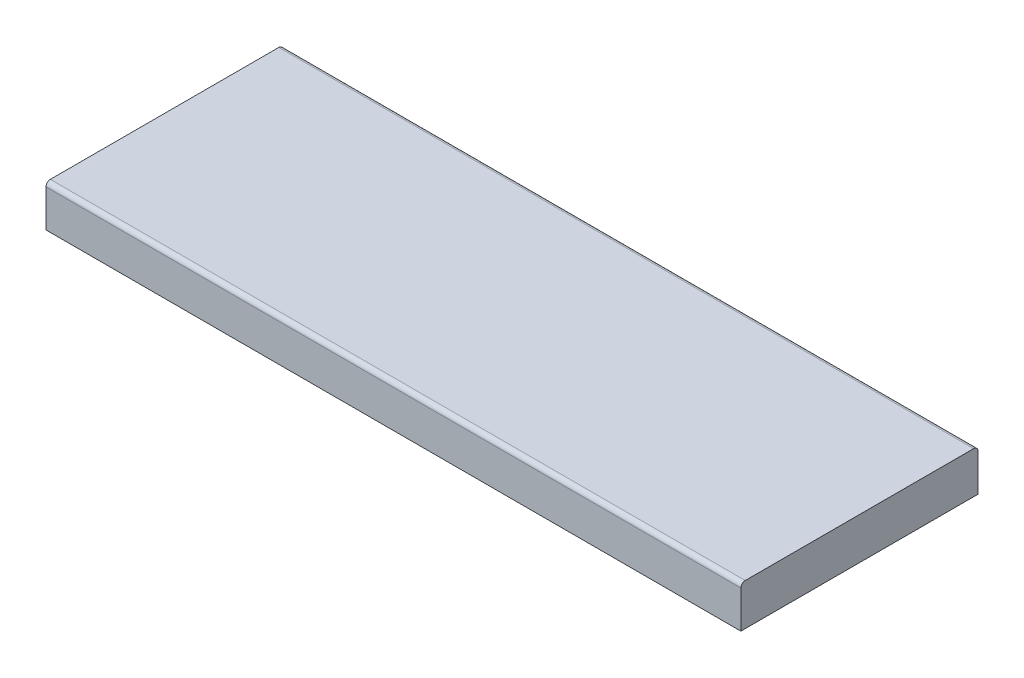
ISO-10303-21;
HEADER;
FILE_DESCRIPTION(('STEP AP214'),'2;1');
FILE_NAME('part.step','',(''),(''),'','','');
FILE_SCHEMA(('AUTOMOTIVE_DESIGN { 1 0 10303 214 1 1 1 1 }'));
ENDSEC;
DATA;
#1=APPLICATION_CONTEXT('core data for automotive mechanical design processes');
#2=APPLICATION_PROTOCOL_DEFINITION('international standard','automotive_design',2000,#1);
#3=PRODUCT_CONTEXT('',#1,'mechanical');
#4=PRODUCT('Part','Part','',(#3));
#5=PRODUCT_RELATED_PRODUCT_CATEGORY('part','',(#4));
#6=PRODUCT_DEFINITION_FORMATION('','',#4);
#7=PRODUCT_DEFINITION_CONTEXT('part definition',#1,'design');
#8=PRODUCT_DEFINITION('design','',#6,#7);
#9=PRODUCT_DEFINITION_SHAPE('','',#8);
#10=(LENGTH_UNIT() NAMED_UNIT(*) SI_UNIT(.MILLI.,.METRE.));
#11=(NAMED_UNIT(*) PLANE_ANGLE_UNIT() SI_UNIT($,.RADIAN.));
#12=(NAMED_UNIT(*) SI_UNIT($,.STERADIAN.) SOLID_ANGLE_UNIT());
#13=UNCERTAINTY_MEASURE_WITH_UNIT(LENGTH_MEASURE(1.E-05),#10,'distance_accuracy_value','');
#14=(GEOMETRIC_REPRESENTATION_CONTEXT(3) GLOBAL_UNCERTAINTY_ASSIGNED_CONTEXT((#13)) GLOBAL_UNIT_ASSIGNED_CONTEXT((#10,
#11,#12)) REPRESENTATION_CONTEXT('',''));
#15=CARTESIAN_POINT('',(0.,0.,0.));
#16=DIRECTION('',(0.,0.,1.));
#17=DIRECTION('',(1.,0.,0.));
#18=AXIS2_PLACEMENT_3D('',#15,#16,#17);
#19=CARTESIAN_POINT('',(80.,9.6,27.3));
#20=DIRECTION('',(-1.,0.,0.));
#21=DIRECTION('',(0.,0.,1.));
#22=AXIS2_PLACEMENT_3D('',#19,#20,#21);
#23=PLANE('',#22);
#24=DIRECTION('',(0.,-1.,0.));
#25=VECTOR('',#24,1.);
#26=CARTESIAN_POINT('',(80.,9.6,-27.3));
#27=LINE('',#26,#25);
#28=CARTESIAN_POINT('',(80.,8.6,-27.3));
#29=VERTEX_POINT('',#28);
#30=CARTESIAN_POINT('',(80.,0.,-27.3));
#31=VERTEX_POINT('',#30);
#32=EDGE_CURVE('E90',#29,#31,#27,.T.);
#33=ORIENTED_EDGE('',*,*,#32,.F.);
#34=CARTESIAN_POINT('',(80.,8.6,-26.3));
#35=DIRECTION('',(-1.,0.,0.));
#36=DIRECTION('',(0.,0.,1.));
#37=AXIS2_PLACEMENT_3D('',#34,#35,#36);
#38=CIRCLE('',#37,1.);
#39=CARTESIAN_POINT('',(80.,9.6,-26.3));
#40=VERTEX_POINT('',#39);
#41=EDGE_CURVE('E47',#29,#40,#38,.F.);
#42=ORIENTED_EDGE('',*,*,#41,.T.);
#43=DIRECTION('',(0.,0.,-1.));
#44=VECTOR('',#43,1.);
#45=CARTESIAN_POINT('',(80.,9.6,27.3));
#46=LINE('',#45,#44);
#47=CARTESIAN_POINT('',(80.,9.6,26.3));
#48=VERTEX_POINT('',#47);
#49=EDGE_CURVE('E123',#48,#40,#46,.T.);
#50=ORIENTED_EDGE('',*,*,#49,.F.);
#51=CARTESIAN_POINT('',(80.,8.6,26.3));
#52=DIRECTION('',(-1.,0.,0.));
#53=DIRECTION('',(0.,0.,1.));
#54=AXIS2_PLACEMENT_3D('',#51,#52,#53);
#55=CIRCLE('',#54,1.);
#56=CARTESIAN_POINT('',(80.,8.6,27.3));
#57=VERTEX_POINT('',#56);
#58=EDGE_CURVE('E54',#48,#57,#55,.F.);
#59=ORIENTED_EDGE('',*,*,#58,.T.);
#60=DIRECTION('',(0.,-1.,0.));
#61=VECTOR('',#60,1.);
#62=CARTESIAN_POINT('',(80.,9.6,27.3));
#63=LINE('',#62,#61);
#64=CARTESIAN_POINT('',(80.,0.,27.3));
#65=VERTEX_POINT('',#64);
#66=EDGE_CURVE('E110',#57,#65,#63,.T.);
#67=ORIENTED_EDGE('',*,*,#66,.T.);
#68=DIRECTION('',(0.,0.,-1.));
#69=VECTOR('',#68,1.);
#70=CARTESIAN_POINT('',(80.,0.,27.3));
#71=LINE('',#70,#69);
#72=EDGE_CURVE('E105',#65,#31,#71,.T.);
#73=ORIENTED_EDGE('',*,*,#72,.T.);
#74=EDGE_LOOP('',(#33,#42,#50,#59,#67,#73));
#75=FACE_BOUND('',#74,.T.);
#76=ADVANCED_FACE('F38',(#75),#23,.F.);
#77=CARTESIAN_POINT('',(-80.,9.6,-27.3));
#78=DIRECTION('',(0.,0.,1.));
#79=DIRECTION('',(1.,0.,0.));
#80=AXIS2_PLACEMENT_3D('',#77,#78,#79);
#81=PLANE('',#80);
#82=DIRECTION('',(0.,-1.,0.));
#83=VECTOR('',#82,1.);
#84=CARTESIAN_POINT('',(-80.,9.6,-27.3));
#85=LINE('',#84,#83);
#86=CARTESIAN_POINT('',(-80.,8.6,-27.3));
#87=VERTEX_POINT('',#86);
#88=CARTESIAN_POINT('',(-80.,0.,-27.3));
#89=VERTEX_POINT('',#88);
#90=EDGE_CURVE('E99',#87,#89,#85,.T.);
#91=ORIENTED_EDGE('',*,*,#90,.F.);
#92=DIRECTION('',(-1.,0.,0.));
#93=VECTOR('',#92,1.);
#94=CARTESIAN_POINT('',(-80.,8.6,-27.3));
#95=LINE('',#94,#93);
#96=EDGE_CURVE('E62',#87,#29,#95,.F.);
#97=ORIENTED_EDGE('',*,*,#96,.T.);
#98=ORIENTED_EDGE('',*,*,#32,.T.);
#99=DIRECTION('',(-1.,0.,0.));
#100=VECTOR('',#99,1.);
#101=CARTESIAN_POINT('',(-80.,0.,-27.3));
#102=LINE('',#101,#100);
#103=EDGE_CURVE('E93',#31,#89,#102,.T.);
#104=ORIENTED_EDGE('',*,*,#103,.T.);
#105=EDGE_LOOP('',(#91,#97,#98,#104));
#106=FACE_BOUND('',#105,.T.);
#107=ADVANCED_FACE('F92',(#106),#81,.F.);
#108=CARTESIAN_POINT('',(-80.,9.6,27.3));
#109=DIRECTION('',(1.,0.,0.));
#110=DIRECTION('',(0.,0.,-1.));
#111=AXIS2_PLACEMENT_3D('',#108,#109,#110);
#112=PLANE('',#111);
#113=DIRECTION('',(0.,0.,1.));
#114=VECTOR('',#113,1.);
#115=CARTESIAN_POINT('',(-80.,9.6,27.3));
#116=LINE('',#115,#114);
#117=CARTESIAN_POINT('',(-80.,9.6,-26.3));
#118=VERTEX_POINT('',#117);
#119=CARTESIAN_POINT('',(-80.,9.6,26.3));
#120=VERTEX_POINT('',#119);
#121=EDGE_CURVE('E115',#118,#120,#116,.T.);
#122=ORIENTED_EDGE('',*,*,#121,.F.);
#123=CARTESIAN_POINT('',(-80.,8.6,-26.3));
#124=DIRECTION('',(1.,0.,0.));
#125=DIRECTION('',(0.,0.,-1.));
#126=AXIS2_PLACEMENT_3D('',#123,#124,#125);
#127=CIRCLE('',#126,1.);
#128=EDGE_CURVE('E141',#118,#87,#127,.F.);
#129=ORIENTED_EDGE('',*,*,#128,.T.);
#130=ORIENTED_EDGE('',*,*,#90,.T.);
#131=DIRECTION('',(0.,0.,1.));
#132=VECTOR('',#131,1.);
#133=CARTESIAN_POINT('',(-80.,0.,27.3));
#134=LINE('',#133,#132);
#135=CARTESIAN_POINT('',(-80.,0.,27.3));
#136=VERTEX_POINT('',#135);
#137=EDGE_CURVE('E107',#89,#136,#134,.T.);
#138=ORIENTED_EDGE('',*,*,#137,.T.);
#139=DIRECTION('',(0.,-1.,0.));
#140=VECTOR('',#139,1.);
#141=CARTESIAN_POINT('',(-80.,9.6,27.3));
#142=LINE('',#141,#140);
#143=CARTESIAN_POINT('',(-80.,8.6,27.3));
#144=VERTEX_POINT('',#143);
#145=EDGE_CURVE('E126',#144,#136,#142,.T.);
#146=ORIENTED_EDGE('',*,*,#145,.F.);
#147=CARTESIAN_POINT('',(-80.,8.6,26.3));
#148=DIRECTION('',(1.,0.,0.));
#149=DIRECTION('',(0.,0.,-1.));
#150=AXIS2_PLACEMENT_3D('',#147,#148,#149);
#151=CIRCLE('',#150,1.);
#152=EDGE_CURVE('E138',#144,#120,#151,.F.);
#153=ORIENTED_EDGE('',*,*,#152,.T.);
#154=EDGE_LOOP('',(#122,#129,#130,#138,#146,#153));
#155=FACE_BOUND('',#154,.T.);
#156=ADVANCED_FACE('F159',(#155),#112,.F.);
#157=CARTESIAN_POINT('',(-80.,9.6,27.3));
#158=DIRECTION('',(0.,0.,-1.));
#159=DIRECTION('',(-1.,0.,0.));
#160=AXIS2_PLACEMENT_3D('',#157,#158,#159);
#161=PLANE('',#160);
#162=ORIENTED_EDGE('',*,*,#66,.F.);
#163=DIRECTION('',(1.,0.,0.));
#164=VECTOR('',#163,1.);
#165=CARTESIAN_POINT('',(-80.,8.6,27.3));
#166=LINE('',#165,#164);
#167=EDGE_CURVE('E11',#57,#144,#166,.F.);
#168=ORIENTED_EDGE('',*,*,#167,.T.);
#169=ORIENTED_EDGE('',*,*,#145,.T.);
#170=DIRECTION('',(1.,0.,0.));
#171=VECTOR('',#170,1.);
#172=CARTESIAN_POINT('',(-80.,0.,27.3));
#173=LINE('',#172,#171);
#174=EDGE_CURVE('E120',#136,#65,#173,.T.);
#175=ORIENTED_EDGE('',*,*,#174,.T.);
#176=EDGE_LOOP('',(#162,#168,#169,#175));
#177=FACE_BOUND('',#176,.T.);
#178=ADVANCED_FACE('F166',(#177),#161,.F.);
#179=CARTESIAN_POINT('',(0.,9.6,0.));
#180=DIRECTION('',(0.,-1.,0.));
#181=DIRECTION('',(0.,0.,-1.));
#182=AXIS2_PLACEMENT_3D('',#179,#180,#181);
#183=PLANE('',#182);
#184=ORIENTED_EDGE('',*,*,#49,.T.);
#185=DIRECTION('',(-1.,0.,0.));
#186=VECTOR('',#185,1.);
#187=CARTESIAN_POINT('',(0.,9.6,-26.3));
#188=LINE('',#187,#186);
#189=EDGE_CURVE('E134',#40,#118,#188,.T.);
#190=ORIENTED_EDGE('',*,*,#189,.T.);
#191=ORIENTED_EDGE('',*,*,#121,.T.);
#192=DIRECTION('',(1.,0.,0.));
#193=VECTOR('',#192,1.);
#194=CARTESIAN_POINT('',(0.,9.6,26.3));
#195=LINE('',#194,#193);
#196=EDGE_CURVE('E98',#120,#48,#195,.T.);
#197=ORIENTED_EDGE('',*,*,#196,.T.);
#198=EDGE_LOOP('',(#184,#190,#191,#197));
#199=FACE_BOUND('',#198,.T.);
#200=ADVANCED_FACE('F152',(#199),#183,.F.);
#201=CARTESIAN_POINT('',(0.,0.,0.));
#202=DIRECTION('',(0.,-1.,0.));
#203=DIRECTION('',(0.,0.,-1.));
#204=AXIS2_PLACEMENT_3D('',#201,#202,#203);
#205=PLANE('',#204);
#206=ORIENTED_EDGE('',*,*,#72,.F.);
#207=ORIENTED_EDGE('',*,*,#174,.F.);
#208=ORIENTED_EDGE('',*,*,#137,.F.);
#209=ORIENTED_EDGE('',*,*,#103,.F.);
#210=EDGE_LOOP('',(#206,#207,#208,#209));
#211=FACE_BOUND('',#210,.T.);
#212=ADVANCED_FACE('F103',(#211),#205,.T.);
#213=CARTESIAN_POINT('',(0.,8.6,-26.3));
#214=DIRECTION('',(-1.,0.,0.));
#215=DIRECTION('',(0.,0.,1.));
#216=AXIS2_PLACEMENT_3D('',#213,#214,#215);
#217=CYLINDRICAL_SURFACE('',#216,1.);
#218=ORIENTED_EDGE('',*,*,#41,.F.);
#219=ORIENTED_EDGE('',*,*,#96,.F.);
#220=ORIENTED_EDGE('',*,*,#128,.F.);
#221=ORIENTED_EDGE('',*,*,#189,.F.);
#222=EDGE_LOOP('',(#218,#219,#220,#221));
#223=FACE_BOUND('',#222,.T.);
#224=ADVANCED_FACE('F157',(#223),#217,.T.);
#225=CARTESIAN_POINT('',(0.,8.6,26.3));
#226=DIRECTION('',(1.,0.,0.));
#227=DIRECTION('',(0.,0.,-1.));
#228=AXIS2_PLACEMENT_3D('',#225,#226,#227);
#229=CYLINDRICAL_SURFACE('',#228,1.);
#230=ORIENTED_EDGE('',*,*,#152,.F.);
#231=ORIENTED_EDGE('',*,*,#167,.F.);
#232=ORIENTED_EDGE('',*,*,#58,.F.);
#233=ORIENTED_EDGE('',*,*,#196,.F.);
#234=EDGE_LOOP('',(#230,#231,#232,#233));
#235=FACE_BOUND('',#234,.T.);
#236=ADVANCED_FACE('F40',(#235),#229,.T.);
#237=CLOSED_SHELL('',(#76,#107,#156,#178,#200,#212,#224,#236));
#238=MANIFOLD_SOLID_BREP('B2',#237);
#239=ADVANCED_BREP_SHAPE_REPRESENTATION('',(#18,#238),#14);
#240=SHAPE_DEFINITION_REPRESENTATION(#9,#239);
ENDSEC;
END-ISO-10303-21;
